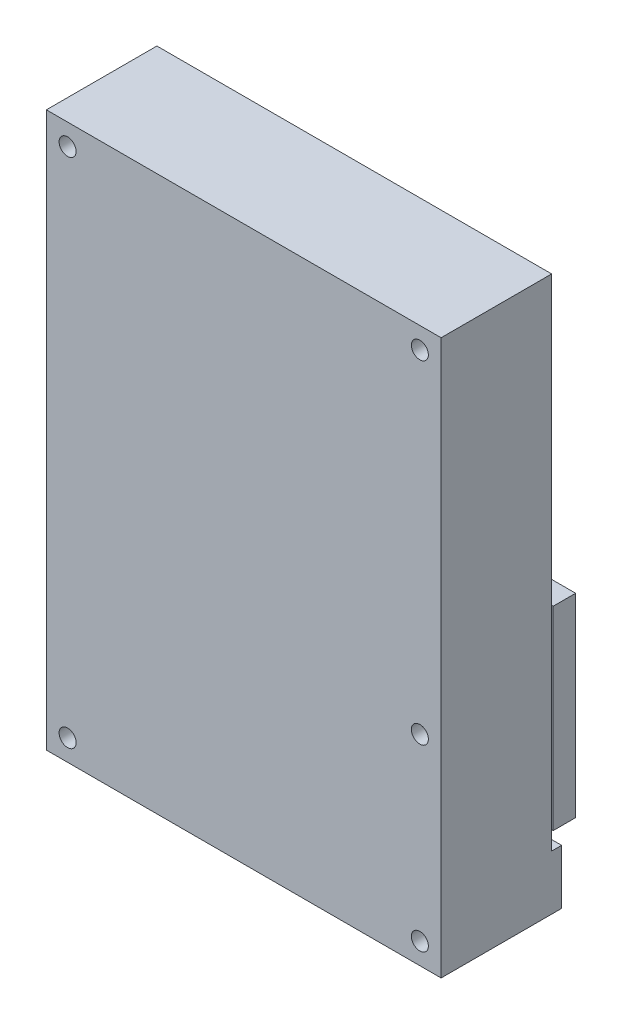
ISO-10303-21;
HEADER;
FILE_DESCRIPTION(('STEP AP214'),'2;1');
FILE_NAME('part.step','',(''),(''),'','','');
FILE_SCHEMA(('AUTOMOTIVE_DESIGN { 1 0 10303 214 1 1 1 1 }'));
ENDSEC;
DATA;
#1=APPLICATION_CONTEXT('core data for automotive mechanical design processes');
#2=APPLICATION_PROTOCOL_DEFINITION('international standard','automotive_design',2000,#1);
#3=PRODUCT_CONTEXT('',#1,'mechanical');
#4=PRODUCT('Part','Part','',(#3));
#5=PRODUCT_RELATED_PRODUCT_CATEGORY('part','',(#4));
#6=PRODUCT_DEFINITION_FORMATION('','',#4);
#7=PRODUCT_DEFINITION_CONTEXT('part definition',#1,'design');
#8=PRODUCT_DEFINITION('design','',#6,#7);
#9=PRODUCT_DEFINITION_SHAPE('','',#8);
#10=(LENGTH_UNIT() NAMED_UNIT(*) SI_UNIT(.MILLI.,.METRE.));
#11=(NAMED_UNIT(*) PLANE_ANGLE_UNIT() SI_UNIT($,.RADIAN.));
#12=(NAMED_UNIT(*) SI_UNIT($,.STERADIAN.) SOLID_ANGLE_UNIT());
#13=UNCERTAINTY_MEASURE_WITH_UNIT(LENGTH_MEASURE(1.E-05),#10,'distance_accuracy_value','');
#14=(GEOMETRIC_REPRESENTATION_CONTEXT(3) GLOBAL_UNCERTAINTY_ASSIGNED_CONTEXT((#13)) GLOBAL_UNIT_ASSIGNED_CONTEXT((#10,
#11,#12)) REPRESENTATION_CONTEXT('',''));
#15=CARTESIAN_POINT('',(0.,0.,0.));
#16=DIRECTION('',(0.,0.,1.));
#17=DIRECTION('',(1.,0.,0.));
#18=AXIS2_PLACEMENT_3D('',#15,#16,#17);
#19=CARTESIAN_POINT('',(-30.6623406658097,-56.429179331307,18.2));
#20=DIRECTION('',(0.,1.,0.));
#21=DIRECTION('',(0.,0.,1.));
#22=AXIS2_PLACEMENT_3D('',#19,#20,#21);
#23=PLANE('',#22);
#24=DIRECTION('',(0.,0.,-1.));
#25=VECTOR('',#24,1.);
#26=CARTESIAN_POINT('',(-30.6623406658097,-56.429179331307,18.2));
#27=LINE('',#26,#25);
#28=CARTESIAN_POINT('',(-30.6623406658097,-56.429179331307,18.2));
#29=VERTEX_POINT('',#28);
#30=CARTESIAN_POINT('',(-30.6623406658097,-56.429179331307,-1.64));
#31=VERTEX_POINT('',#30);
#32=EDGE_CURVE('E11',#29,#31,#27,.T.);
#33=ORIENTED_EDGE('',*,*,#32,.T.);
#34=DIRECTION('',(-1.,0.,0.));
#35=VECTOR('',#34,1.);
#36=CARTESIAN_POINT('',(34.3376593341903,-56.429179331307,-1.64));
#37=LINE('',#36,#35);
#38=CARTESIAN_POINT('',(34.3376593341903,-56.429179331307,-1.64));
#39=VERTEX_POINT('',#38);
#40=EDGE_CURVE('E257',#39,#31,#37,.T.);
#41=ORIENTED_EDGE('',*,*,#40,.F.);
#42=DIRECTION('',(0.,0.,-1.));
#43=VECTOR('',#42,1.);
#44=CARTESIAN_POINT('',(34.3376593341903,-56.429179331307,18.2));
#45=LINE('',#44,#43);
#46=CARTESIAN_POINT('',(34.3376593341903,-56.429179331307,18.2));
#47=VERTEX_POINT('',#46);
#48=EDGE_CURVE('E43',#47,#39,#45,.T.);
#49=ORIENTED_EDGE('',*,*,#48,.F.);
#50=DIRECTION('',(1.,0.,0.));
#51=VECTOR('',#50,1.);
#52=CARTESIAN_POINT('',(-30.6623406658097,-56.429179331307,18.2));
#53=LINE('',#52,#51);
#54=EDGE_CURVE('E276',#29,#47,#53,.T.);
#55=ORIENTED_EDGE('',*,*,#54,.F.);
#56=EDGE_LOOP('',(#33,#41,#49,#55));
#57=FACE_BOUND('',#56,.T.);
#58=DIRECTION('',(0.,0.,1.));
#59=VECTOR('',#58,1.);
#60=CARTESIAN_POINT('',(15.4376593341903,-56.429179331307,3.2));
#61=LINE('',#60,#59);
#62=CARTESIAN_POINT('',(15.4376593341903,-56.429179331307,2.95));
#63=VERTEX_POINT('',#62);
#64=CARTESIAN_POINT('',(15.4376593341903,-56.429179331307,3.2));
#65=VERTEX_POINT('',#64);
#66=EDGE_CURVE('E227',#63,#65,#61,.T.);
#67=ORIENTED_EDGE('',*,*,#66,.F.);
#68=DIRECTION('',(1.,0.,0.));
#69=VECTOR('',#68,1.);
#70=CARTESIAN_POINT('',(15.4376593341903,-56.429179331307,2.95));
#71=LINE('',#70,#69);
#72=CARTESIAN_POINT('',(-18.7623406658097,-56.429179331307,2.95));
#73=VERTEX_POINT('',#72);
#74=EDGE_CURVE('E233',#73,#63,#71,.T.);
#75=ORIENTED_EDGE('',*,*,#74,.F.);
#76=DIRECTION('',(0.,0.,-1.));
#77=VECTOR('',#76,1.);
#78=CARTESIAN_POINT('',(-18.7623406658097,-56.429179331307,3.2));
#79=LINE('',#78,#77);
#80=CARTESIAN_POINT('',(-18.7623406658097,-56.429179331307,3.2));
#81=VERTEX_POINT('',#80);
#82=EDGE_CURVE('E56',#81,#73,#79,.T.);
#83=ORIENTED_EDGE('',*,*,#82,.F.);
#84=DIRECTION('',(-1.,0.,0.));
#85=VECTOR('',#84,1.);
#86=CARTESIAN_POINT('',(15.4376593341903,-56.429179331307,3.2));
#87=LINE('',#86,#85);
#88=EDGE_CURVE('E51',#65,#81,#87,.T.);
#89=ORIENTED_EDGE('',*,*,#88,.F.);
#90=EDGE_LOOP('',(#67,#75,#83,#89));
#91=FACE_BOUND('',#90,.T.);
#92=ADVANCED_FACE('F34',(#57,#91),#23,.F.);
#93=CARTESIAN_POINT('',(0.,0.,0.));
#94=DIRECTION('',(0.,0.,1.));
#95=DIRECTION('',(1.,0.,0.));
#96=AXIS2_PLACEMENT_3D('',#93,#94,#95);
#97=PLANE('',#96);
#98=CARTESIAN_POINT('',(30.8376593341903,-23.429179331307,0.));
#99=DIRECTION('',(0.,0.,1.));
#100=DIRECTION('',(1.,0.,0.));
#101=AXIS2_PLACEMENT_3D('',#98,#99,#100);
#102=CIRCLE('',#101,1.4);
#103=CARTESIAN_POINT('',(32.2376593341903,-23.429179331307,0.));
#104=VERTEX_POINT('',#103);
#105=EDGE_CURVE('E455',#104,#104,#102,.T.);
#106=ORIENTED_EDGE('',*,*,#105,.T.);
#107=EDGE_LOOP('',(#106));
#108=FACE_BOUND('',#107,.T.);
#109=CARTESIAN_POINT('',(-27.1623406658097,31.370820668693,0.));
#110=DIRECTION('',(0.,0.,1.));
#111=DIRECTION('',(1.,0.,0.));
#112=AXIS2_PLACEMENT_3D('',#109,#110,#111);
#113=CIRCLE('',#112,1.4);
#114=CARTESIAN_POINT('',(-25.7623406658097,31.370820668693,0.));
#115=VERTEX_POINT('',#114);
#116=EDGE_CURVE('E301',#115,#115,#113,.T.);
#117=ORIENTED_EDGE('',*,*,#116,.T.);
#118=EDGE_LOOP('',(#117));
#119=FACE_BOUND('',#118,.T.);
#120=CARTESIAN_POINT('',(30.8376593341903,31.370820668693,0.));
#121=DIRECTION('',(0.,0.,1.));
#122=DIRECTION('',(1.,0.,0.));
#123=AXIS2_PLACEMENT_3D('',#120,#121,#122);
#124=CIRCLE('',#123,1.4);
#125=CARTESIAN_POINT('',(32.2376593341903,31.370820668693,0.));
#126=VERTEX_POINT('',#125);
#127=EDGE_CURVE('E317',#126,#126,#124,.T.);
#128=ORIENTED_EDGE('',*,*,#127,.T.);
#129=EDGE_LOOP('',(#128));
#130=FACE_BOUND('',#129,.T.);
#131=DIRECTION('',(1.,0.,0.));
#132=VECTOR('',#131,1.);
#133=CARTESIAN_POINT('',(34.3376593341903,-47.4291793313064,0.));
#134=LINE('',#133,#132);
#135=CARTESIAN_POINT('',(-30.6623406658097,-47.4291793313064,0.));
#136=VERTEX_POINT('',#135);
#137=CARTESIAN_POINT('',(34.3376593341903,-47.4291793313064,0.));
#138=VERTEX_POINT('',#137);
#139=EDGE_CURVE('E253',#136,#138,#134,.T.);
#140=ORIENTED_EDGE('',*,*,#139,.F.);
#141=DIRECTION('',(0.,-1.,0.));
#142=VECTOR('',#141,1.);
#143=CARTESIAN_POINT('',(-30.6623406658097,34.870820668693,0.));
#144=LINE('',#143,#142);
#145=CARTESIAN_POINT('',(-30.6623406658097,34.870820668693,0.));
#146=VERTEX_POINT('',#145);
#147=EDGE_CURVE('E272',#146,#136,#144,.T.);
#148=ORIENTED_EDGE('',*,*,#147,.F.);
#149=DIRECTION('',(-1.,0.,0.));
#150=VECTOR('',#149,1.);
#151=CARTESIAN_POINT('',(-30.6623406658097,34.870820668693,0.));
#152=LINE('',#151,#150);
#153=CARTESIAN_POINT('',(34.3376593341903,34.870820668693,0.));
#154=VERTEX_POINT('',#153);
#155=EDGE_CURVE('E277',#154,#146,#152,.T.);
#156=ORIENTED_EDGE('',*,*,#155,.F.);
#157=DIRECTION('',(0.,1.,0.));
#158=VECTOR('',#157,1.);
#159=CARTESIAN_POINT('',(34.3376593341903,34.870820668693,0.));
#160=LINE('',#159,#158);
#161=EDGE_CURVE('E286',#138,#154,#160,.T.);
#162=ORIENTED_EDGE('',*,*,#161,.F.);
#163=EDGE_LOOP('',(#140,#148,#156,#162));
#164=FACE_BOUND('',#163,.T.);
#165=ADVANCED_FACE('F351',(#108,#119,#130,#164),#97,.F.);
#166=CARTESIAN_POINT('',(-30.6623406658097,34.870820668693,18.2));
#167=DIRECTION('',(1.,0.,0.));
#168=DIRECTION('',(0.,1.,0.));
#169=AXIS2_PLACEMENT_3D('',#166,#167,#168);
#170=PLANE('',#169);
#171=ORIENTED_EDGE('',*,*,#147,.T.);
#172=DIRECTION('',(0.,0.,1.));
#173=VECTOR('',#172,1.);
#174=CARTESIAN_POINT('',(-30.6623406658097,-47.4291793313064,-1.64));
#175=LINE('',#174,#173);
#176=CARTESIAN_POINT('',(-30.6623406658097,-47.4291793313064,-1.64));
#177=VERTEX_POINT('',#176);
#178=EDGE_CURVE('E269',#177,#136,#175,.T.);
#179=ORIENTED_EDGE('',*,*,#178,.F.);
#180=DIRECTION('',(0.,1.,0.));
#181=VECTOR('',#180,1.);
#182=CARTESIAN_POINT('',(-30.6623406658097,-56.429179331307,-1.64));
#183=LINE('',#182,#181);
#184=EDGE_CURVE('E260',#31,#177,#183,.T.);
#185=ORIENTED_EDGE('',*,*,#184,.F.);
#186=ORIENTED_EDGE('',*,*,#32,.F.);
#187=DIRECTION('',(0.,-1.,0.));
#188=VECTOR('',#187,1.);
#189=CARTESIAN_POINT('',(-30.6623406658097,34.870820668693,18.2));
#190=LINE('',#189,#188);
#191=CARTESIAN_POINT('',(-30.6623406658097,34.870820668693,18.2));
#192=VERTEX_POINT('',#191);
#193=EDGE_CURVE('E273',#192,#29,#190,.T.);
#194=ORIENTED_EDGE('',*,*,#193,.F.);
#195=DIRECTION('',(0.,0.,-1.));
#196=VECTOR('',#195,1.);
#197=CARTESIAN_POINT('',(-30.6623406658097,34.870820668693,18.2));
#198=LINE('',#197,#196);
#199=EDGE_CURVE('E283',#192,#146,#198,.T.);
#200=ORIENTED_EDGE('',*,*,#199,.T.);
#201=EDGE_LOOP('',(#171,#179,#185,#186,#194,#200));
#202=FACE_BOUND('',#201,.T.);
#203=ADVANCED_FACE('F36',(#202),#170,.F.);
#204=CARTESIAN_POINT('',(34.3376593341903,34.870820668693,18.2));
#205=DIRECTION('',(-1.,0.,0.));
#206=DIRECTION('',(0.,-1.,0.));
#207=AXIS2_PLACEMENT_3D('',#204,#205,#206);
#208=PLANE('',#207);
#209=ORIENTED_EDGE('',*,*,#48,.T.);
#210=DIRECTION('',(0.,-1.,0.));
#211=VECTOR('',#210,1.);
#212=CARTESIAN_POINT('',(34.3376593341903,-56.429179331307,-1.64));
#213=LINE('',#212,#211);
#214=CARTESIAN_POINT('',(34.3376593341903,-47.4291793313064,-1.64));
#215=VERTEX_POINT('',#214);
#216=EDGE_CURVE('E254',#215,#39,#213,.T.);
#217=ORIENTED_EDGE('',*,*,#216,.F.);
#218=DIRECTION('',(0.,0.,1.));
#219=VECTOR('',#218,1.);
#220=CARTESIAN_POINT('',(34.3376593341903,-47.4291793313064,-1.64));
#221=LINE('',#220,#219);
#222=EDGE_CURVE('E264',#215,#138,#221,.T.);
#223=ORIENTED_EDGE('',*,*,#222,.T.);
#224=ORIENTED_EDGE('',*,*,#161,.T.);
#225=DIRECTION('',(0.,0.,-1.));
#226=VECTOR('',#225,1.);
#227=CARTESIAN_POINT('',(34.3376593341903,34.870820668693,18.2));
#228=LINE('',#227,#226);
#229=CARTESIAN_POINT('',(34.3376593341903,34.870820668693,18.2));
#230=VERTEX_POINT('',#229);
#231=EDGE_CURVE('E291',#230,#154,#228,.T.);
#232=ORIENTED_EDGE('',*,*,#231,.F.);
#233=DIRECTION('',(0.,1.,0.));
#234=VECTOR('',#233,1.);
#235=CARTESIAN_POINT('',(34.3376593341903,34.870820668693,18.2));
#236=LINE('',#235,#234);
#237=EDGE_CURVE('E279',#47,#230,#236,.T.);
#238=ORIENTED_EDGE('',*,*,#237,.F.);
#239=EDGE_LOOP('',(#209,#217,#223,#224,#232,#238));
#240=FACE_BOUND('',#239,.T.);
#241=ADVANCED_FACE('F359',(#240),#208,.F.);
#242=CARTESIAN_POINT('',(-30.6623406658097,34.870820668693,18.2));
#243=DIRECTION('',(0.,-1.,0.));
#244=DIRECTION('',(0.,0.,-1.));
#245=AXIS2_PLACEMENT_3D('',#242,#243,#244);
#246=PLANE('',#245);
#247=ORIENTED_EDGE('',*,*,#155,.T.);
#248=ORIENTED_EDGE('',*,*,#199,.F.);
#249=DIRECTION('',(-1.,0.,0.));
#250=VECTOR('',#249,1.);
#251=CARTESIAN_POINT('',(-30.6623406658097,34.870820668693,18.2));
#252=LINE('',#251,#250);
#253=EDGE_CURVE('E281',#230,#192,#252,.T.);
#254=ORIENTED_EDGE('',*,*,#253,.F.);
#255=ORIENTED_EDGE('',*,*,#231,.T.);
#256=EDGE_LOOP('',(#247,#248,#254,#255));
#257=FACE_BOUND('',#256,.T.);
#258=ADVANCED_FACE('F362',(#257),#246,.F.);
#259=CARTESIAN_POINT('',(0.,0.,18.2));
#260=DIRECTION('',(0.,0.,1.));
#261=DIRECTION('',(1.,0.,0.));
#262=AXIS2_PLACEMENT_3D('',#259,#260,#261);
#263=PLANE('',#262);
#264=CARTESIAN_POINT('',(30.8376593341903,-23.429179331307,18.2));
#265=DIRECTION('',(0.,0.,1.));
#266=DIRECTION('',(1.,0.,0.));
#267=AXIS2_PLACEMENT_3D('',#264,#265,#266);
#268=CIRCLE('',#267,1.4);
#269=CARTESIAN_POINT('',(32.2376593341903,-23.429179331307,18.2));
#270=VERTEX_POINT('',#269);
#271=EDGE_CURVE('E452',#270,#270,#268,.T.);
#272=ORIENTED_EDGE('',*,*,#271,.F.);
#273=EDGE_LOOP('',(#272));
#274=FACE_BOUND('',#273,.T.);
#275=CARTESIAN_POINT('',(-27.1623406658097,-52.929179331307,18.2));
#276=DIRECTION('',(0.,0.,1.));
#277=DIRECTION('',(1.,0.,0.));
#278=AXIS2_PLACEMENT_3D('',#275,#276,#277);
#279=CIRCLE('',#278,1.4);
#280=CARTESIAN_POINT('',(-25.7623406658097,-52.929179331307,18.2));
#281=VERTEX_POINT('',#280);
#282=EDGE_CURVE('E308',#281,#281,#279,.T.);
#283=ORIENTED_EDGE('',*,*,#282,.F.);
#284=EDGE_LOOP('',(#283));
#285=FACE_BOUND('',#284,.T.);
#286=CARTESIAN_POINT('',(30.8376593341903,-52.929179331307,18.2));
#287=DIRECTION('',(0.,0.,1.));
#288=DIRECTION('',(1.,0.,0.));
#289=AXIS2_PLACEMENT_3D('',#286,#287,#288);
#290=CIRCLE('',#289,1.4);
#291=CARTESIAN_POINT('',(32.2376593341903,-52.929179331307,18.2));
#292=VERTEX_POINT('',#291);
#293=EDGE_CURVE('E297',#292,#292,#290,.T.);
#294=ORIENTED_EDGE('',*,*,#293,.F.);
#295=EDGE_LOOP('',(#294));
#296=FACE_BOUND('',#295,.T.);
#297=CARTESIAN_POINT('',(-27.1623406658097,31.370820668693,18.2));
#298=DIRECTION('',(0.,0.,1.));
#299=DIRECTION('',(1.,0.,0.));
#300=AXIS2_PLACEMENT_3D('',#297,#298,#299);
#301=CIRCLE('',#300,1.4);
#302=CARTESIAN_POINT('',(-25.7623406658097,31.370820668693,18.2));
#303=VERTEX_POINT('',#302);
#304=EDGE_CURVE('E296',#303,#303,#301,.T.);
#305=ORIENTED_EDGE('',*,*,#304,.F.);
#306=EDGE_LOOP('',(#305));
#307=FACE_BOUND('',#306,.T.);
#308=CARTESIAN_POINT('',(30.8376593341903,31.370820668693,18.2));
#309=DIRECTION('',(0.,0.,1.));
#310=DIRECTION('',(1.,0.,0.));
#311=AXIS2_PLACEMENT_3D('',#308,#309,#310);
#312=CIRCLE('',#311,1.4);
#313=CARTESIAN_POINT('',(32.2376593341903,31.370820668693,18.2));
#314=VERTEX_POINT('',#313);
#315=EDGE_CURVE('E314',#314,#314,#312,.T.);
#316=ORIENTED_EDGE('',*,*,#315,.F.);
#317=EDGE_LOOP('',(#316));
#318=FACE_BOUND('',#317,.T.);
#319=ORIENTED_EDGE('',*,*,#193,.T.);
#320=ORIENTED_EDGE('',*,*,#54,.T.);
#321=ORIENTED_EDGE('',*,*,#237,.T.);
#322=ORIENTED_EDGE('',*,*,#253,.T.);
#323=EDGE_LOOP('',(#319,#320,#321,#322));
#324=FACE_BOUND('',#323,.T.);
#325=ADVANCED_FACE('F365',(#274,#285,#296,#307,#318,#324),#263,.T.);
#326=CARTESIAN_POINT('',(34.3376593341903,-47.4291793313064,-1.64));
#327=DIRECTION('',(0.,-1.,0.));
#328=DIRECTION('',(0.,0.,-1.));
#329=AXIS2_PLACEMENT_3D('',#326,#327,#328);
#330=PLANE('',#329);
#331=ORIENTED_EDGE('',*,*,#139,.T.);
#332=ORIENTED_EDGE('',*,*,#222,.F.);
#333=DIRECTION('',(1.,0.,0.));
#334=VECTOR('',#333,1.);
#335=CARTESIAN_POINT('',(34.3376593341903,-47.4291793313064,-1.64));
#336=LINE('',#335,#334);
#337=EDGE_CURVE('E262',#177,#215,#336,.T.);
#338=ORIENTED_EDGE('',*,*,#337,.F.);
#339=ORIENTED_EDGE('',*,*,#178,.T.);
#340=EDGE_LOOP('',(#331,#332,#338,#339));
#341=FACE_BOUND('',#340,.T.);
#342=ADVANCED_FACE('F370',(#341),#330,.F.);
#343=CARTESIAN_POINT('',(0.,0.,-1.64));
#344=DIRECTION('',(0.,0.,1.));
#345=DIRECTION('',(1.,0.,0.));
#346=AXIS2_PLACEMENT_3D('',#343,#344,#345);
#347=PLANE('',#346);
#348=CARTESIAN_POINT('',(-27.1623406658097,-52.929179331307,-1.64));
#349=DIRECTION('',(0.,0.,1.));
#350=DIRECTION('',(1.,0.,0.));
#351=AXIS2_PLACEMENT_3D('',#348,#349,#350);
#352=CIRCLE('',#351,1.4);
#353=CARTESIAN_POINT('',(-25.7623406658097,-52.929179331307,-1.64));
#354=VERTEX_POINT('',#353);
#355=EDGE_CURVE('E38',#354,#354,#352,.T.);
#356=ORIENTED_EDGE('',*,*,#355,.T.);
#357=EDGE_LOOP('',(#356));
#358=FACE_BOUND('',#357,.T.);
#359=CARTESIAN_POINT('',(30.8376593341903,-52.929179331307,-1.64));
#360=DIRECTION('',(0.,0.,1.));
#361=DIRECTION('',(1.,0.,0.));
#362=AXIS2_PLACEMENT_3D('',#359,#360,#361);
#363=CIRCLE('',#362,1.4);
#364=CARTESIAN_POINT('',(32.2376593341903,-52.929179331307,-1.64));
#365=VERTEX_POINT('',#364);
#366=EDGE_CURVE('E294',#365,#365,#363,.T.);
#367=ORIENTED_EDGE('',*,*,#366,.T.);
#368=EDGE_LOOP('',(#367));
#369=FACE_BOUND('',#368,.T.);
#370=ORIENTED_EDGE('',*,*,#216,.T.);
#371=ORIENTED_EDGE('',*,*,#40,.T.);
#372=ORIENTED_EDGE('',*,*,#184,.T.);
#373=ORIENTED_EDGE('',*,*,#337,.T.);
#374=EDGE_LOOP('',(#370,#371,#372,#373));
#375=FACE_BOUND('',#374,.T.);
#376=ADVANCED_FACE('F374',(#358,#369,#375),#347,.F.);
#377=CARTESIAN_POINT('',(15.4376593341903,-62.039179331307,3.2));
#378=DIRECTION('',(-1.,0.,0.));
#379=DIRECTION('',(0.,0.,1.));
#380=AXIS2_PLACEMENT_3D('',#377,#378,#379);
#381=PLANE('',#380);
#382=ORIENTED_EDGE('',*,*,#66,.T.);
#383=DIRECTION('',(0.,1.,0.));
#384=VECTOR('',#383,1.);
#385=CARTESIAN_POINT('',(15.4376593341903,-62.039179331307,3.2));
#386=LINE('',#385,#384);
#387=CARTESIAN_POINT('',(15.4376593341903,-62.039179331307,3.2));
#388=VERTEX_POINT('',#387);
#389=EDGE_CURVE('E251',#388,#65,#386,.T.);
#390=ORIENTED_EDGE('',*,*,#389,.F.);
#391=CARTESIAN_POINT('',(15.4376593341903,-62.039179331307,-5.80000000000009));
#392=DIRECTION('',(-1.,0.,0.));
#393=DIRECTION('',(0.,0.,-1.));
#394=AXIS2_PLACEMENT_3D('',#391,#392,#393);
#395=CIRCLE('',#394,9.);
#396=CARTESIAN_POINT('',(15.4376593341903,-62.039179331307,-14.8000000000001));
#397=VERTEX_POINT('',#396);
#398=EDGE_CURVE('E215',#397,#388,#395,.T.);
#399=ORIENTED_EDGE('',*,*,#398,.F.);
#400=DIRECTION('',(0.,-1.,0.));
#401=VECTOR('',#400,1.);
#402=CARTESIAN_POINT('',(15.4376593341903,-57.939179331307,-14.8));
#403=LINE('',#402,#401);
#404=CARTESIAN_POINT('',(15.4376593341903,-57.939179331307,-14.8));
#405=VERTEX_POINT('',#404);
#406=EDGE_CURVE('E203',#405,#397,#403,.T.);
#407=ORIENTED_EDGE('',*,*,#406,.F.);
#408=DIRECTION('',(0.,0.,-1.));
#409=VECTOR('',#408,1.);
#410=CARTESIAN_POINT('',(15.4376593341903,-57.939179331307,-14.8));
#411=LINE('',#410,#409);
#412=CARTESIAN_POINT('',(15.4376593341903,-57.939179331307,-14.5500000000001));
#413=VERTEX_POINT('',#412);
#414=EDGE_CURVE('E194',#413,#405,#411,.T.);
#415=ORIENTED_EDGE('',*,*,#414,.F.);
#416=DIRECTION('',(0.,-1.,0.));
#417=VECTOR('',#416,1.);
#418=CARTESIAN_POINT('',(15.4376593341903,-57.939179331307,-14.5500000000001));
#419=LINE('',#418,#417);
#420=CARTESIAN_POINT('',(15.4376593341903,-62.039179331307,-14.5500000000001));
#421=VERTEX_POINT('',#420);
#422=EDGE_CURVE('E206',#413,#421,#419,.T.);
#423=ORIENTED_EDGE('',*,*,#422,.T.);
#424=CARTESIAN_POINT('',(15.4376593341903,-62.039179331307,-5.80000000000009));
#425=DIRECTION('',(1.,0.,0.));
#426=DIRECTION('',(0.,0.,-1.));
#427=AXIS2_PLACEMENT_3D('',#424,#425,#426);
#428=CIRCLE('',#427,8.75);
#429=CARTESIAN_POINT('',(15.4376593341903,-62.039179331307,2.95));
#430=VERTEX_POINT('',#429);
#431=EDGE_CURVE('E213',#430,#421,#428,.T.);
#432=ORIENTED_EDGE('',*,*,#431,.F.);
#433=DIRECTION('',(0.,1.,0.));
#434=VECTOR('',#433,1.);
#435=CARTESIAN_POINT('',(15.4376593341903,-62.039179331307,2.95));
#436=LINE('',#435,#434);
#437=EDGE_CURVE('E236',#430,#63,#436,.T.);
#438=ORIENTED_EDGE('',*,*,#437,.T.);
#439=EDGE_LOOP('',(#382,#390,#399,#407,#415,#423,#432,#438));
#440=FACE_BOUND('',#439,.T.);
#441=ADVANCED_FACE('F378',(#440),#381,.F.);
#442=CARTESIAN_POINT('',(15.4376593341903,-62.039179331307,3.2));
#443=DIRECTION('',(0.,0.,-1.));
#444=DIRECTION('',(-1.,0.,0.));
#445=AXIS2_PLACEMENT_3D('',#442,#443,#444);
#446=PLANE('',#445);
#447=ORIENTED_EDGE('',*,*,#88,.T.);
#448=DIRECTION('',(0.,1.,0.));
#449=VECTOR('',#448,1.);
#450=CARTESIAN_POINT('',(-18.7623406658097,-62.039179331307,3.2));
#451=LINE('',#450,#449);
#452=CARTESIAN_POINT('',(-18.7623406658097,-62.039179331307,3.2));
#453=VERTEX_POINT('',#452);
#454=EDGE_CURVE('E248',#453,#81,#451,.T.);
#455=ORIENTED_EDGE('',*,*,#454,.F.);
#456=DIRECTION('',(-1.,0.,0.));
#457=VECTOR('',#456,1.);
#458=CARTESIAN_POINT('',(15.4376593341903,-62.039179331307,3.2));
#459=LINE('',#458,#457);
#460=EDGE_CURVE('E229',#388,#453,#459,.T.);
#461=ORIENTED_EDGE('',*,*,#460,.F.);
#462=ORIENTED_EDGE('',*,*,#389,.T.);
#463=EDGE_LOOP('',(#447,#455,#461,#462));
#464=FACE_BOUND('',#463,.T.);
#465=ADVANCED_FACE('F382',(#464),#446,.F.);
#466=CARTESIAN_POINT('',(-18.7623406658097,-62.039179331307,3.2));
#467=DIRECTION('',(1.,0.,0.));
#468=DIRECTION('',(0.,0.,-1.));
#469=AXIS2_PLACEMENT_3D('',#466,#467,#468);
#470=PLANE('',#469);
#471=ORIENTED_EDGE('',*,*,#82,.T.);
#472=DIRECTION('',(0.,1.,0.));
#473=VECTOR('',#472,1.);
#474=CARTESIAN_POINT('',(-18.7623406658097,-62.039179331307,2.95));
#475=LINE('',#474,#473);
#476=CARTESIAN_POINT('',(-18.7623406658097,-62.039179331307,2.95));
#477=VERTEX_POINT('',#476);
#478=EDGE_CURVE('E245',#477,#73,#475,.T.);
#479=ORIENTED_EDGE('',*,*,#478,.F.);
#480=CARTESIAN_POINT('',(-18.7623406658097,-62.039179331307,-5.8));
#481=DIRECTION('',(1.,0.,0.));
#482=DIRECTION('',(0.,0.,-1.));
#483=AXIS2_PLACEMENT_3D('',#480,#481,#482);
#484=CIRCLE('',#483,8.75);
#485=CARTESIAN_POINT('',(-18.7623406658097,-62.039179331307,-14.55));
#486=VERTEX_POINT('',#485);
#487=EDGE_CURVE('E212',#477,#486,#484,.T.);
#488=ORIENTED_EDGE('',*,*,#487,.T.);
#489=DIRECTION('',(0.,-1.,0.));
#490=VECTOR('',#489,1.);
#491=CARTESIAN_POINT('',(-18.7623406658097,-57.939179331307,-14.5500000000001));
#492=LINE('',#491,#490);
#493=CARTESIAN_POINT('',(-18.7623406658097,-57.939179331307,-14.5500000000001));
#494=VERTEX_POINT('',#493);
#495=EDGE_CURVE('E209',#494,#486,#492,.T.);
#496=ORIENTED_EDGE('',*,*,#495,.F.);
#497=DIRECTION('',(0.,0.,1.));
#498=VECTOR('',#497,1.);
#499=CARTESIAN_POINT('',(-18.7623406658097,-57.939179331307,-14.8));
#500=LINE('',#499,#498);
#501=CARTESIAN_POINT('',(-18.7623406658097,-57.939179331307,-14.8));
#502=VERTEX_POINT('',#501);
#503=EDGE_CURVE('E183',#502,#494,#500,.T.);
#504=ORIENTED_EDGE('',*,*,#503,.F.);
#505=DIRECTION('',(0.,-1.,0.));
#506=VECTOR('',#505,1.);
#507=CARTESIAN_POINT('',(-18.7623406658097,-57.939179331307,-14.8));
#508=LINE('',#507,#506);
#509=CARTESIAN_POINT('',(-18.7623406658097,-62.039179331307,-14.8));
#510=VERTEX_POINT('',#509);
#511=EDGE_CURVE('E200',#502,#510,#508,.T.);
#512=ORIENTED_EDGE('',*,*,#511,.T.);
#513=CARTESIAN_POINT('',(-18.7623406658097,-62.039179331307,-5.8));
#514=DIRECTION('',(-1.,0.,0.));
#515=DIRECTION('',(0.,0.,-1.));
#516=AXIS2_PLACEMENT_3D('',#513,#514,#515);
#517=CIRCLE('',#516,9.);
#518=EDGE_CURVE('E216',#510,#453,#517,.T.);
#519=ORIENTED_EDGE('',*,*,#518,.T.);
#520=ORIENTED_EDGE('',*,*,#454,.T.);
#521=EDGE_LOOP('',(#471,#479,#488,#496,#504,#512,#519,#520));
#522=FACE_BOUND('',#521,.T.);
#523=ADVANCED_FACE('F386',(#522),#470,.F.);
#524=CARTESIAN_POINT('',(15.4376593341903,-62.039179331307,2.95));
#525=DIRECTION('',(0.,0.,1.));
#526=DIRECTION('',(1.,0.,0.));
#527=AXIS2_PLACEMENT_3D('',#524,#525,#526);
#528=PLANE('',#527);
#529=ORIENTED_EDGE('',*,*,#74,.T.);
#530=ORIENTED_EDGE('',*,*,#437,.F.);
#531=DIRECTION('',(1.,0.,0.));
#532=VECTOR('',#531,1.);
#533=CARTESIAN_POINT('',(15.4376593341903,-62.039179331307,2.95));
#534=LINE('',#533,#532);
#535=EDGE_CURVE('E232',#477,#430,#534,.T.);
#536=ORIENTED_EDGE('',*,*,#535,.F.);
#537=ORIENTED_EDGE('',*,*,#478,.T.);
#538=EDGE_LOOP('',(#529,#530,#536,#537));
#539=FACE_BOUND('',#538,.T.);
#540=ADVANCED_FACE('F390',(#539),#528,.F.);
#541=CARTESIAN_POINT('',(15.4376593341903,-62.039179331307,-5.80000000000009));
#542=DIRECTION('',(-1.,0.,0.));
#543=DIRECTION('',(0.,0.,1.));
#544=AXIS2_PLACEMENT_3D('',#541,#542,#543);
#545=CYLINDRICAL_SURFACE('',#544,8.75);
#546=ORIENTED_EDGE('',*,*,#487,.F.);
#547=ORIENTED_EDGE('',*,*,#535,.T.);
#548=ORIENTED_EDGE('',*,*,#431,.T.);
#549=DIRECTION('',(-1.,0.,0.));
#550=VECTOR('',#549,1.);
#551=CARTESIAN_POINT('',(15.4376593341903,-62.039179331307,-14.5500000000001));
#552=LINE('',#551,#550);
#553=EDGE_CURVE('E219',#421,#486,#552,.T.);
#554=ORIENTED_EDGE('',*,*,#553,.T.);
#555=EDGE_LOOP('',(#546,#547,#548,#554));
#556=FACE_BOUND('',#555,.T.);
#557=ADVANCED_FACE('F394',(#556),#545,.F.);
#558=CARTESIAN_POINT('',(15.4376593341903,-62.039179331307,-5.80000000000009));
#559=DIRECTION('',(-1.,0.,0.));
#560=DIRECTION('',(0.,0.,1.));
#561=AXIS2_PLACEMENT_3D('',#558,#559,#560);
#562=CYLINDRICAL_SURFACE('',#561,9.);
#563=ORIENTED_EDGE('',*,*,#518,.F.);
#564=DIRECTION('',(-1.,0.,0.));
#565=VECTOR('',#564,1.);
#566=CARTESIAN_POINT('',(15.4376593341903,-62.039179331307,-14.8000000000001));
#567=LINE('',#566,#565);
#568=EDGE_CURVE('E224',#397,#510,#567,.T.);
#569=ORIENTED_EDGE('',*,*,#568,.F.);
#570=ORIENTED_EDGE('',*,*,#398,.T.);
#571=ORIENTED_EDGE('',*,*,#460,.T.);
#572=EDGE_LOOP('',(#563,#569,#570,#571));
#573=FACE_BOUND('',#572,.T.);
#574=ADVANCED_FACE('F398',(#573),#562,.T.);
#575=CARTESIAN_POINT('',(-18.7623406658097,-57.939179331307,-14.5500000000001));
#576=DIRECTION('',(0.,0.,-1.));
#577=DIRECTION('',(-1.,0.,0.));
#578=AXIS2_PLACEMENT_3D('',#575,#576,#577);
#579=PLANE('',#578);
#580=ORIENTED_EDGE('',*,*,#553,.F.);
#581=ORIENTED_EDGE('',*,*,#422,.F.);
#582=DIRECTION('',(1.,0.,0.));
#583=VECTOR('',#582,1.);
#584=CARTESIAN_POINT('',(-18.7623406658097,-57.939179331307,-14.5500000000001));
#585=LINE('',#584,#583);
#586=EDGE_CURVE('E186',#494,#413,#585,.T.);
#587=ORIENTED_EDGE('',*,*,#586,.F.);
#588=ORIENTED_EDGE('',*,*,#495,.T.);
#589=EDGE_LOOP('',(#580,#581,#587,#588));
#590=FACE_BOUND('',#589,.T.);
#591=ADVANCED_FACE('F402',(#590),#579,.F.);
#592=CARTESIAN_POINT('',(-18.7623406658097,-57.939179331307,-14.8));
#593=DIRECTION('',(0.,0.,1.));
#594=DIRECTION('',(1.,0.,0.));
#595=AXIS2_PLACEMENT_3D('',#592,#593,#594);
#596=PLANE('',#595);
#597=ORIENTED_EDGE('',*,*,#568,.T.);
#598=ORIENTED_EDGE('',*,*,#511,.F.);
#599=DIRECTION('',(-1.,0.,0.));
#600=VECTOR('',#599,1.);
#601=CARTESIAN_POINT('',(-18.7623406658097,-57.939179331307,-14.8));
#602=LINE('',#601,#600);
#603=EDGE_CURVE('E197',#405,#502,#602,.T.);
#604=ORIENTED_EDGE('',*,*,#603,.F.);
#605=ORIENTED_EDGE('',*,*,#406,.T.);
#606=EDGE_LOOP('',(#597,#598,#604,#605));
#607=FACE_BOUND('',#606,.T.);
#608=ADVANCED_FACE('F406',(#607),#596,.F.);
#609=CARTESIAN_POINT('',(0.,-57.939179331307,0.));
#610=DIRECTION('',(0.,1.,0.));
#611=DIRECTION('',(0.,0.,1.));
#612=AXIS2_PLACEMENT_3D('',#609,#610,#611);
#613=PLANE('',#612);
#614=DIRECTION('',(0.,0.,1.));
#615=VECTOR('',#614,1.);
#616=CARTESIAN_POINT('',(-24.3623406658097,-57.939179331307,-17.25));
#617=LINE('',#616,#615);
#618=CARTESIAN_POINT('',(-24.3623406658097,-57.939179331307,-17.25));
#619=VERTEX_POINT('',#618);
#620=CARTESIAN_POINT('',(-24.3623406658097,-57.939179331307,-13.5500000000001));
#621=VERTEX_POINT('',#620);
#622=EDGE_CURVE('E182',#619,#621,#617,.T.);
#623=ORIENTED_EDGE('',*,*,#622,.F.);
#624=DIRECTION('',(-1.,0.,0.));
#625=VECTOR('',#624,1.);
#626=CARTESIAN_POINT('',(-24.3623406658097,-57.939179331307,-17.25));
#627=LINE('',#626,#625);
#628=CARTESIAN_POINT('',(21.0376593341903,-57.939179331307,-17.25));
#629=VERTEX_POINT('',#628);
#630=EDGE_CURVE('E178',#629,#619,#627,.T.);
#631=ORIENTED_EDGE('',*,*,#630,.F.);
#632=DIRECTION('',(0.,0.,-1.));
#633=VECTOR('',#632,1.);
#634=CARTESIAN_POINT('',(21.0376593341903,-57.939179331307,-17.25));
#635=LINE('',#634,#633);
#636=CARTESIAN_POINT('',(21.0376593341903,-57.939179331307,-13.5500000000001));
#637=VERTEX_POINT('',#636);
#638=EDGE_CURVE('E326',#637,#629,#635,.T.);
#639=ORIENTED_EDGE('',*,*,#638,.F.);
#640=DIRECTION('',(1.,0.,0.));
#641=VECTOR('',#640,1.);
#642=CARTESIAN_POINT('',(-24.3623406658097,-57.939179331307,-13.5500000000001));
#643=LINE('',#642,#641);
#644=EDGE_CURVE('E324',#621,#637,#643,.T.);
#645=ORIENTED_EDGE('',*,*,#644,.F.);
#646=EDGE_LOOP('',(#623,#631,#639,#645));
#647=FACE_BOUND('',#646,.T.);
#648=ORIENTED_EDGE('',*,*,#503,.T.);
#649=ORIENTED_EDGE('',*,*,#586,.T.);
#650=ORIENTED_EDGE('',*,*,#414,.T.);
#651=ORIENTED_EDGE('',*,*,#603,.T.);
#652=EDGE_LOOP('',(#648,#649,#650,#651));
#653=FACE_BOUND('',#652,.T.);
#654=ADVANCED_FACE('F337',(#647,#653),#613,.F.);
#655=CARTESIAN_POINT('',(-24.3623406658097,-25.939179331307,-17.25));
#656=DIRECTION('',(1.,0.,0.));
#657=DIRECTION('',(0.,0.,-1.));
#658=AXIS2_PLACEMENT_3D('',#655,#656,#657);
#659=PLANE('',#658);
#660=ORIENTED_EDGE('',*,*,#622,.T.);
#661=DIRECTION('',(0.,-1.,0.));
#662=VECTOR('',#661,1.);
#663=CARTESIAN_POINT('',(-24.3623406658097,-25.939179331307,-13.5500000000001));
#664=LINE('',#663,#662);
#665=CARTESIAN_POINT('',(-24.3623406658097,-25.939179331307,-13.5500000000001));
#666=VERTEX_POINT('',#665);
#667=EDGE_CURVE('E162',#666,#621,#664,.T.);
#668=ORIENTED_EDGE('',*,*,#667,.F.);
#669=DIRECTION('',(0.,0.,1.));
#670=VECTOR('',#669,1.);
#671=CARTESIAN_POINT('',(-24.3623406658097,-25.939179331307,-17.25));
#672=LINE('',#671,#670);
#673=CARTESIAN_POINT('',(-24.3623406658097,-25.939179331307,-17.25));
#674=VERTEX_POINT('',#673);
#675=EDGE_CURVE('E169',#674,#666,#672,.T.);
#676=ORIENTED_EDGE('',*,*,#675,.F.);
#677=DIRECTION('',(0.,-1.,0.));
#678=VECTOR('',#677,1.);
#679=CARTESIAN_POINT('',(-24.3623406658097,-25.939179331307,-17.25));
#680=LINE('',#679,#678);
#681=EDGE_CURVE('E322',#674,#619,#680,.T.);
#682=ORIENTED_EDGE('',*,*,#681,.T.);
#683=EDGE_LOOP('',(#660,#668,#676,#682));
#684=FACE_BOUND('',#683,.T.);
#685=ADVANCED_FACE('F180',(#684),#659,.F.);
#686=CARTESIAN_POINT('',(-24.3623406658097,-25.939179331307,-13.5500000000001));
#687=DIRECTION('',(0.,0.,-1.));
#688=DIRECTION('',(-1.,0.,0.));
#689=AXIS2_PLACEMENT_3D('',#686,#687,#688);
#690=PLANE('',#689);
#691=CARTESIAN_POINT('',(18.3376593341903,-39.939179331307,-13.5500000000001));
#692=DIRECTION('',(0.,0.,-1.));
#693=DIRECTION('',(-1.,0.,0.));
#694=AXIS2_PLACEMENT_3D('',#691,#692,#693);
#695=CIRCLE('',#694,1.3);
#696=CARTESIAN_POINT('',(17.0376593341903,-39.939179331307,-13.5500000000001));
#697=VERTEX_POINT('',#696);
#698=EDGE_CURVE('E459',#697,#697,#695,.T.);
#699=ORIENTED_EDGE('',*,*,#698,.T.);
#700=EDGE_LOOP('',(#699));
#701=FACE_BOUND('',#700,.T.);
#702=CARTESIAN_POINT('',(-21.6623406658097,-39.939179331307,-13.5500000000001));
#703=DIRECTION('',(0.,0.,-1.));
#704=DIRECTION('',(-1.,0.,0.));
#705=AXIS2_PLACEMENT_3D('',#702,#703,#704);
#706=CIRCLE('',#705,1.3);
#707=CARTESIAN_POINT('',(-22.9623406658097,-39.939179331307,-13.5500000000001));
#708=VERTEX_POINT('',#707);
#709=EDGE_CURVE('E467',#708,#708,#706,.T.);
#710=ORIENTED_EDGE('',*,*,#709,.T.);
#711=EDGE_LOOP('',(#710));
#712=FACE_BOUND('',#711,.T.);
#713=ORIENTED_EDGE('',*,*,#644,.T.);
#714=DIRECTION('',(0.,-1.,0.));
#715=VECTOR('',#714,1.);
#716=CARTESIAN_POINT('',(21.0376593341903,-25.939179331307,-13.5500000000001));
#717=LINE('',#716,#715);
#718=CARTESIAN_POINT('',(21.0376593341903,-25.939179331307,-13.5500000000001));
#719=VERTEX_POINT('',#718);
#720=EDGE_CURVE('E165',#719,#637,#717,.T.);
#721=ORIENTED_EDGE('',*,*,#720,.F.);
#722=DIRECTION('',(1.,0.,0.));
#723=VECTOR('',#722,1.);
#724=CARTESIAN_POINT('',(-24.3623406658097,-25.939179331307,-13.5500000000001));
#725=LINE('',#724,#723);
#726=EDGE_CURVE('E158',#666,#719,#725,.T.);
#727=ORIENTED_EDGE('',*,*,#726,.F.);
#728=ORIENTED_EDGE('',*,*,#667,.T.);
#729=EDGE_LOOP('',(#713,#721,#727,#728));
#730=FACE_BOUND('',#729,.T.);
#731=ADVANCED_FACE('F160',(#701,#712,#730),#690,.F.);
#732=CARTESIAN_POINT('',(21.0376593341903,-25.939179331307,-17.25));
#733=DIRECTION('',(-1.,0.,0.));
#734=DIRECTION('',(0.,0.,1.));
#735=AXIS2_PLACEMENT_3D('',#732,#733,#734);
#736=PLANE('',#735);
#737=ORIENTED_EDGE('',*,*,#638,.T.);
#738=DIRECTION('',(0.,-1.,0.));
#739=VECTOR('',#738,1.);
#740=CARTESIAN_POINT('',(21.0376593341903,-25.939179331307,-17.25));
#741=LINE('',#740,#739);
#742=CARTESIAN_POINT('',(21.0376593341903,-25.939179331307,-17.25));
#743=VERTEX_POINT('',#742);
#744=EDGE_CURVE('E188',#743,#629,#741,.T.);
#745=ORIENTED_EDGE('',*,*,#744,.F.);
#746=DIRECTION('',(0.,0.,-1.));
#747=VECTOR('',#746,1.);
#748=CARTESIAN_POINT('',(21.0376593341903,-25.939179331307,-17.25));
#749=LINE('',#748,#747);
#750=EDGE_CURVE('E168',#719,#743,#749,.T.);
#751=ORIENTED_EDGE('',*,*,#750,.F.);
#752=ORIENTED_EDGE('',*,*,#720,.T.);
#753=EDGE_LOOP('',(#737,#745,#751,#752));
#754=FACE_BOUND('',#753,.T.);
#755=ADVANCED_FACE('F339',(#754),#736,.F.);
#756=CARTESIAN_POINT('',(-24.3623406658097,-25.939179331307,-17.25));
#757=DIRECTION('',(0.,0.,1.));
#758=DIRECTION('',(1.,0.,0.));
#759=AXIS2_PLACEMENT_3D('',#756,#757,#758);
#760=PLANE('',#759);
#761=CARTESIAN_POINT('',(18.3376593341903,-39.939179331307,-17.25));
#762=DIRECTION('',(0.,0.,-1.));
#763=DIRECTION('',(-1.,0.,0.));
#764=AXIS2_PLACEMENT_3D('',#761,#762,#763);
#765=CIRCLE('',#764,1.3);
#766=CARTESIAN_POINT('',(17.0376593341903,-39.939179331307,-17.25));
#767=VERTEX_POINT('',#766);
#768=EDGE_CURVE('E456',#767,#767,#765,.T.);
#769=ORIENTED_EDGE('',*,*,#768,.F.);
#770=EDGE_LOOP('',(#769));
#771=FACE_BOUND('',#770,.T.);
#772=CARTESIAN_POINT('',(-21.6623406658097,-39.939179331307,-17.25));
#773=DIRECTION('',(0.,0.,-1.));
#774=DIRECTION('',(-1.,0.,0.));
#775=AXIS2_PLACEMENT_3D('',#772,#773,#774);
#776=CIRCLE('',#775,1.3);
#777=CARTESIAN_POINT('',(-22.9623406658097,-39.939179331307,-17.25));
#778=VERTEX_POINT('',#777);
#779=EDGE_CURVE('E465',#778,#778,#776,.T.);
#780=ORIENTED_EDGE('',*,*,#779,.F.);
#781=EDGE_LOOP('',(#780));
#782=FACE_BOUND('',#781,.T.);
#783=ORIENTED_EDGE('',*,*,#630,.T.);
#784=ORIENTED_EDGE('',*,*,#681,.F.);
#785=DIRECTION('',(-1.,0.,0.));
#786=VECTOR('',#785,1.);
#787=CARTESIAN_POINT('',(-24.3623406658097,-25.939179331307,-17.25));
#788=LINE('',#787,#786);
#789=EDGE_CURVE('E174',#743,#674,#788,.T.);
#790=ORIENTED_EDGE('',*,*,#789,.F.);
#791=ORIENTED_EDGE('',*,*,#744,.T.);
#792=EDGE_LOOP('',(#783,#784,#790,#791));
#793=FACE_BOUND('',#792,.T.);
#794=ADVANCED_FACE('F333',(#771,#782,#793),#760,.F.);
#795=CARTESIAN_POINT('',(0.,-25.939179331307,0.));
#796=DIRECTION('',(0.,1.,0.));
#797=DIRECTION('',(0.,0.,1.));
#798=AXIS2_PLACEMENT_3D('',#795,#796,#797);
#799=PLANE('',#798);
#800=ORIENTED_EDGE('',*,*,#675,.T.);
#801=ORIENTED_EDGE('',*,*,#726,.T.);
#802=ORIENTED_EDGE('',*,*,#750,.T.);
#803=ORIENTED_EDGE('',*,*,#789,.T.);
#804=EDGE_LOOP('',(#800,#801,#802,#803));
#805=FACE_BOUND('',#804,.T.);
#806=ADVANCED_FACE('F172',(#805),#799,.T.);
#807=CARTESIAN_POINT('',(30.8376593341903,31.370820668693,-13.8));
#808=DIRECTION('',(0.,0.,1.));
#809=DIRECTION('',(1.,0.,0.));
#810=AXIS2_PLACEMENT_3D('',#807,#808,#809);
#811=CYLINDRICAL_SURFACE('',#810,1.4);
#812=ORIENTED_EDGE('',*,*,#315,.T.);
#813=EDGE_LOOP('',(#812));
#814=FACE_BOUND('',#813,.T.);
#815=ORIENTED_EDGE('',*,*,#127,.F.);
#816=EDGE_LOOP('',(#815));
#817=FACE_BOUND('',#816,.T.);
#818=ADVANCED_FACE('F421',(#814,#817),#811,.F.);
#819=CARTESIAN_POINT('',(-27.1623406658097,31.370820668693,-42.8));
#820=DIRECTION('',(0.,0.,1.));
#821=DIRECTION('',(1.,0.,0.));
#822=AXIS2_PLACEMENT_3D('',#819,#820,#821);
#823=CYLINDRICAL_SURFACE('',#822,1.4);
#824=ORIENTED_EDGE('',*,*,#304,.T.);
#825=EDGE_LOOP('',(#824));
#826=FACE_BOUND('',#825,.T.);
#827=ORIENTED_EDGE('',*,*,#116,.F.);
#828=EDGE_LOOP('',(#827));
#829=FACE_BOUND('',#828,.T.);
#830=ADVANCED_FACE('F424',(#826,#829),#823,.F.);
#831=CARTESIAN_POINT('',(30.8376593341903,-52.929179331307,-42.8));
#832=DIRECTION('',(0.,0.,1.));
#833=DIRECTION('',(1.,0.,0.));
#834=AXIS2_PLACEMENT_3D('',#831,#832,#833);
#835=CYLINDRICAL_SURFACE('',#834,1.4);
#836=ORIENTED_EDGE('',*,*,#293,.T.);
#837=EDGE_LOOP('',(#836));
#838=FACE_BOUND('',#837,.T.);
#839=ORIENTED_EDGE('',*,*,#366,.F.);
#840=EDGE_LOOP('',(#839));
#841=FACE_BOUND('',#840,.T.);
#842=ADVANCED_FACE('F428',(#838,#841),#835,.F.);
#843=CARTESIAN_POINT('',(-27.1623406658097,-52.929179331307,-42.8));
#844=DIRECTION('',(0.,0.,1.));
#845=DIRECTION('',(1.,0.,0.));
#846=AXIS2_PLACEMENT_3D('',#843,#844,#845);
#847=CYLINDRICAL_SURFACE('',#846,1.4);
#848=ORIENTED_EDGE('',*,*,#282,.T.);
#849=EDGE_LOOP('',(#848));
#850=FACE_BOUND('',#849,.T.);
#851=ORIENTED_EDGE('',*,*,#355,.F.);
#852=EDGE_LOOP('',(#851));
#853=FACE_BOUND('',#852,.T.);
#854=ADVANCED_FACE('F432',(#850,#853),#847,.F.);
#855=CARTESIAN_POINT('',(-21.6623406658097,-39.939179331307,-7.25));
#856=DIRECTION('',(0.,0.,-1.));
#857=DIRECTION('',(-1.,0.,0.));
#858=AXIS2_PLACEMENT_3D('',#855,#856,#857);
#859=CYLINDRICAL_SURFACE('',#858,1.3);
#860=ORIENTED_EDGE('',*,*,#779,.T.);
#861=EDGE_LOOP('',(#860));
#862=FACE_BOUND('',#861,.T.);
#863=ORIENTED_EDGE('',*,*,#709,.F.);
#864=EDGE_LOOP('',(#863));
#865=FACE_BOUND('',#864,.T.);
#866=ADVANCED_FACE('F435',(#862,#865),#859,.F.);
#867=CARTESIAN_POINT('',(18.3376593341903,-39.939179331307,-7.25));
#868=DIRECTION('',(0.,0.,-1.));
#869=DIRECTION('',(-1.,0.,0.));
#870=AXIS2_PLACEMENT_3D('',#867,#868,#869);
#871=CYLINDRICAL_SURFACE('',#870,1.3);
#872=ORIENTED_EDGE('',*,*,#768,.T.);
#873=EDGE_LOOP('',(#872));
#874=FACE_BOUND('',#873,.T.);
#875=ORIENTED_EDGE('',*,*,#698,.F.);
#876=EDGE_LOOP('',(#875));
#877=FACE_BOUND('',#876,.T.);
#878=ADVANCED_FACE('F439',(#874,#877),#871,.F.);
#879=CARTESIAN_POINT('',(30.8376593341903,-23.429179331307,-1481.8));
#880=DIRECTION('',(0.,0.,1.));
#881=DIRECTION('',(1.,0.,0.));
#882=AXIS2_PLACEMENT_3D('',#879,#880,#881);
#883=CYLINDRICAL_SURFACE('',#882,1.4);
#884=ORIENTED_EDGE('',*,*,#271,.T.);
#885=EDGE_LOOP('',(#884));
#886=FACE_BOUND('',#885,.T.);
#887=ORIENTED_EDGE('',*,*,#105,.F.);
#888=EDGE_LOOP('',(#887));
#889=FACE_BOUND('',#888,.T.);
#890=ADVANCED_FACE('F443',(#886,#889),#883,.F.);
#891=CLOSED_SHELL('',(#92,#165,#203,#241,#258,#325,#342,#376,#441,#465,#523,#540,#557,#574,#591,
#608,#654,#685,#731,#755,#794,#806,#818,#830,#842,#854,#866,#878,#890));
#892=MANIFOLD_SOLID_BREP('B2',#891);
#893=ADVANCED_BREP_SHAPE_REPRESENTATION('',(#18,#892),#14);
#894=SHAPE_DEFINITION_REPRESENTATION(#9,#893);
ENDSEC;
END-ISO-10303-21;
